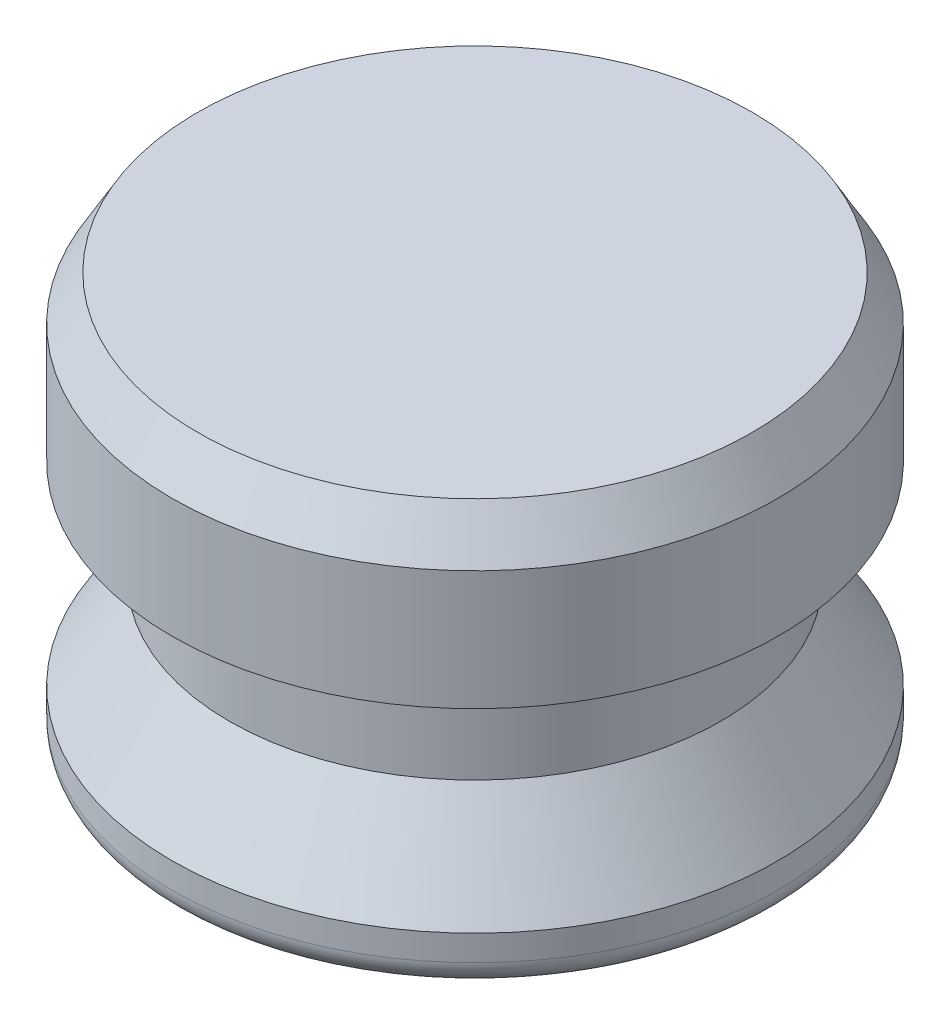
ISO-10303-21;
HEADER;
FILE_DESCRIPTION(('STEP AP214'),'2;1');
FILE_NAME('part.step','',(''),(''),'','','');
FILE_SCHEMA(('AUTOMOTIVE_DESIGN { 1 0 10303 214 1 1 1 1 }'));
ENDSEC;
DATA;
#1=APPLICATION_CONTEXT('core data for automotive mechanical design processes');
#2=APPLICATION_PROTOCOL_DEFINITION('international standard','automotive_design',2000,#1);
#3=PRODUCT_CONTEXT('',#1,'mechanical');
#4=PRODUCT('Part','Part','',(#3));
#5=PRODUCT_RELATED_PRODUCT_CATEGORY('part','',(#4));
#6=PRODUCT_DEFINITION_FORMATION('','',#4);
#7=PRODUCT_DEFINITION_CONTEXT('part definition',#1,'design');
#8=PRODUCT_DEFINITION('design','',#6,#7);
#9=PRODUCT_DEFINITION_SHAPE('','',#8);
#10=(LENGTH_UNIT() NAMED_UNIT(*) SI_UNIT(.MILLI.,.METRE.));
#11=(NAMED_UNIT(*) PLANE_ANGLE_UNIT() SI_UNIT($,.RADIAN.));
#12=(NAMED_UNIT(*) SI_UNIT($,.STERADIAN.) SOLID_ANGLE_UNIT());
#13=UNCERTAINTY_MEASURE_WITH_UNIT(LENGTH_MEASURE(1.E-05),#10,'distance_accuracy_value','');
#14=(GEOMETRIC_REPRESENTATION_CONTEXT(3) GLOBAL_UNCERTAINTY_ASSIGNED_CONTEXT((#13)) GLOBAL_UNIT_ASSIGNED_CONTEXT((#10,
#11,#12)) REPRESENTATION_CONTEXT('',''));
#15=CARTESIAN_POINT('',(0.,0.,0.));
#16=DIRECTION('',(0.,0.,1.));
#17=DIRECTION('',(1.,0.,0.));
#18=AXIS2_PLACEMENT_3D('',#15,#16,#17);
#19=CARTESIAN_POINT('',(0.,0.,0.));
#20=DIRECTION('',(0.,1.,0.));
#21=DIRECTION('',(0.,0.,1.));
#22=AXIS2_PLACEMENT_3D('',#19,#20,#21);
#23=PLANE('',#22);
#24=CARTESIAN_POINT('',(0.,0.,0.));
#25=DIRECTION('',(0.,1.,0.));
#26=DIRECTION('',(0.,0.,1.));
#27=AXIS2_PLACEMENT_3D('',#24,#25,#26);
#28=CIRCLE('',#27,8.60425);
#29=CARTESIAN_POINT('',(0.,0.,8.60425));
#30=VERTEX_POINT('',#29);
#31=EDGE_CURVE('E46',#30,#30,#28,.F.);
#32=ORIENTED_EDGE('',*,*,#31,.T.);
#33=EDGE_LOOP('',(#32));
#34=FACE_BOUND('',#33,.T.);
#35=ADVANCED_FACE('F31',(#34),#23,.F.);
#36=CARTESIAN_POINT('',(0.,0.,0.));
#37=DIRECTION('',(0.,-1.,0.));
#38=DIRECTION('',(0.,0.,-1.));
#39=AXIS2_PLACEMENT_3D('',#36,#37,#38);
#40=CYLINDRICAL_SURFACE('',#39,9.398);
#41=CARTESIAN_POINT('',(0.,0.793749999999999,0.));
#42=DIRECTION('',(0.,1.,0.));
#43=DIRECTION('',(0.,0.,1.));
#44=AXIS2_PLACEMENT_3D('',#41,#42,#43);
#45=CIRCLE('',#44,9.398);
#46=CARTESIAN_POINT('',(0.,0.793749999999999,9.398));
#47=VERTEX_POINT('',#46);
#48=EDGE_CURVE('E42',#47,#47,#45,.T.);
#49=ORIENTED_EDGE('',*,*,#48,.T.);
#50=EDGE_LOOP('',(#49));
#51=FACE_BOUND('',#50,.T.);
#52=CARTESIAN_POINT('',(0.,1.5875,0.));
#53=DIRECTION('',(0.,-1.,0.));
#54=DIRECTION('',(0.,0.,-1.));
#55=AXIS2_PLACEMENT_3D('',#52,#53,#54);
#56=CIRCLE('',#55,9.398);
#57=CARTESIAN_POINT('',(0.,1.5875,-9.398));
#58=VERTEX_POINT('',#57);
#59=EDGE_CURVE('E51',#58,#58,#56,.T.);
#60=ORIENTED_EDGE('',*,*,#59,.T.);
#61=EDGE_LOOP('',(#60));
#62=FACE_BOUND('',#61,.T.);
#63=ADVANCED_FACE('F80',(#51,#62),#40,.T.);
#64=CARTESIAN_POINT('',(0.,4.445,0.));
#65=DIRECTION('',(0.,-1.,0.));
#66=DIRECTION('',(0.,0.,-1.));
#67=AXIS2_PLACEMENT_3D('',#64,#65,#66);
#68=CONICAL_SURFACE('',#67,7.62,0.556599318010223);
#69=ORIENTED_EDGE('',*,*,#59,.F.);
#70=EDGE_LOOP('',(#69));
#71=FACE_BOUND('',#70,.T.);
#72=CARTESIAN_POINT('',(0.,4.445,0.));
#73=DIRECTION('',(0.,-1.,0.));
#74=DIRECTION('',(0.,0.,-1.));
#75=AXIS2_PLACEMENT_3D('',#72,#73,#74);
#76=CIRCLE('',#75,7.62);
#77=CARTESIAN_POINT('',(0.,4.445,-7.62));
#78=VERTEX_POINT('',#77);
#79=EDGE_CURVE('E54',#78,#78,#76,.T.);
#80=ORIENTED_EDGE('',*,*,#79,.T.);
#81=EDGE_LOOP('',(#80));
#82=FACE_BOUND('',#81,.T.);
#83=ADVANCED_FACE('F86',(#71,#82),#68,.T.);
#84=CARTESIAN_POINT('',(0.,0.,0.));
#85=DIRECTION('',(0.,-1.,0.));
#86=DIRECTION('',(0.,0.,-1.));
#87=AXIS2_PLACEMENT_3D('',#84,#85,#86);
#88=CYLINDRICAL_SURFACE('',#87,7.62);
#89=ORIENTED_EDGE('',*,*,#79,.F.);
#90=EDGE_LOOP('',(#89));
#91=FACE_BOUND('',#90,.T.);
#92=CARTESIAN_POINT('',(0.,7.62,0.));
#93=DIRECTION('',(0.,-1.,0.));
#94=DIRECTION('',(0.,0.,-1.));
#95=AXIS2_PLACEMENT_3D('',#92,#93,#94);
#96=CIRCLE('',#95,7.62);
#97=CARTESIAN_POINT('',(0.,7.62,-7.62));
#98=VERTEX_POINT('',#97);
#99=EDGE_CURVE('E57',#98,#98,#96,.T.);
#100=ORIENTED_EDGE('',*,*,#99,.T.);
#101=EDGE_LOOP('',(#100));
#102=FACE_BOUND('',#101,.T.);
#103=ADVANCED_FACE('F76',(#91,#102),#88,.T.);
#104=CARTESIAN_POINT('',(-7.62,7.62,0.));
#105=DIRECTION('',(0.,1.,0.));
#106=DIRECTION('',(0.,0.,1.));
#107=AXIS2_PLACEMENT_3D('',#104,#105,#106);
#108=PLANE('',#107);
#109=ORIENTED_EDGE('',*,*,#99,.F.);
#110=EDGE_LOOP('',(#109));
#111=FACE_BOUND('',#110,.T.);
#112=CARTESIAN_POINT('',(0.,7.62,0.));
#113=DIRECTION('',(0.,-1.,0.));
#114=DIRECTION('',(0.,0.,-1.));
#115=AXIS2_PLACEMENT_3D('',#112,#113,#114);
#116=CIRCLE('',#115,9.398);
#117=CARTESIAN_POINT('',(0.,7.62,-9.398));
#118=VERTEX_POINT('',#117);
#119=EDGE_CURVE('E60',#118,#118,#116,.T.);
#120=ORIENTED_EDGE('',*,*,#119,.T.);
#121=EDGE_LOOP('',(#120));
#122=FACE_BOUND('',#121,.T.);
#123=ADVANCED_FACE('F64',(#111,#122),#108,.F.);
#124=CARTESIAN_POINT('',(0.,0.,0.));
#125=DIRECTION('',(0.,-1.,0.));
#126=DIRECTION('',(0.,0.,-1.));
#127=AXIS2_PLACEMENT_3D('',#124,#125,#126);
#128=CYLINDRICAL_SURFACE('',#127,9.398);
#129=CARTESIAN_POINT('',(0.,11.3251846714922,0.));
#130=DIRECTION('',(0.,-1.,0.));
#131=DIRECTION('',(0.,0.,-1.));
#132=AXIS2_PLACEMENT_3D('',#129,#130,#131);
#133=CIRCLE('',#132,9.398);
#134=CARTESIAN_POINT('',(0.,11.3251846714922,-9.398));
#135=VERTEX_POINT('',#134);
#136=EDGE_CURVE('E38',#135,#135,#133,.T.);
#137=ORIENTED_EDGE('',*,*,#136,.T.);
#138=EDGE_LOOP('',(#137));
#139=FACE_BOUND('',#138,.T.);
#140=ORIENTED_EDGE('',*,*,#119,.F.);
#141=EDGE_LOOP('',(#140));
#142=FACE_BOUND('',#141,.T.);
#143=ADVANCED_FACE('F66',(#139,#142),#128,.T.);
#144=CARTESIAN_POINT('',(-9.398,12.7,0.));
#145=DIRECTION('',(0.,-1.,0.));
#146=DIRECTION('',(0.,0.,-1.));
#147=AXIS2_PLACEMENT_3D('',#144,#145,#146);
#148=PLANE('',#147);
#149=CARTESIAN_POINT('',(0.,12.7,0.));
#150=DIRECTION('',(0.,-1.,0.));
#151=DIRECTION('',(0.,0.,-1.));
#152=AXIS2_PLACEMENT_3D('',#149,#150,#151);
#153=CIRCLE('',#152,8.60424999999999);
#154=CARTESIAN_POINT('',(0.,12.7,-8.60424999999999));
#155=VERTEX_POINT('',#154);
#156=EDGE_CURVE('E10',#155,#155,#153,.F.);
#157=ORIENTED_EDGE('',*,*,#156,.T.);
#158=EDGE_LOOP('',(#157));
#159=FACE_BOUND('',#158,.T.);
#160=ADVANCED_FACE('F68',(#159),#148,.F.);
#161=CARTESIAN_POINT('',(0.,0.793749999999999,0.));
#162=DIRECTION('',(0.,1.,0.));
#163=DIRECTION('',(0.,0.,1.));
#164=AXIS2_PLACEMENT_3D('',#161,#162,#163);
#165=TOROIDAL_SURFACE('',#164,8.60425,0.79375);
#166=ORIENTED_EDGE('',*,*,#48,.F.);
#167=EDGE_LOOP('',(#166));
#168=FACE_BOUND('',#167,.T.);
#169=ORIENTED_EDGE('',*,*,#31,.F.);
#170=EDGE_LOOP('',(#169));
#171=FACE_BOUND('',#170,.T.);
#172=ADVANCED_FACE('F74',(#168,#171),#165,.T.);
#173=CARTESIAN_POINT('',(0.,11.3251846714922,0.));
#174=DIRECTION('',(0.,-1.,0.));
#175=DIRECTION('',(0.,0.,-1.));
#176=AXIS2_PLACEMENT_3D('',#173,#174,#175);
#177=CONICAL_SURFACE('',#176,9.398,0.5235987755983);
#178=ORIENTED_EDGE('',*,*,#156,.F.);
#179=EDGE_LOOP('',(#178));
#180=FACE_BOUND('',#179,.T.);
#181=ORIENTED_EDGE('',*,*,#136,.F.);
#182=EDGE_LOOP('',(#181));
#183=FACE_BOUND('',#182,.T.);
#184=ADVANCED_FACE('F33',(#180,#183),#177,.T.);
#185=CLOSED_SHELL('',(#35,#63,#83,#103,#123,#143,#160,#172,#184));
#186=MANIFOLD_SOLID_BREP('B2',#185);
#187=ADVANCED_BREP_SHAPE_REPRESENTATION('',(#18,#186),#14);
#188=SHAPE_DEFINITION_REPRESENTATION(#9,#187);
ENDSEC;
END-ISO-10303-21;
